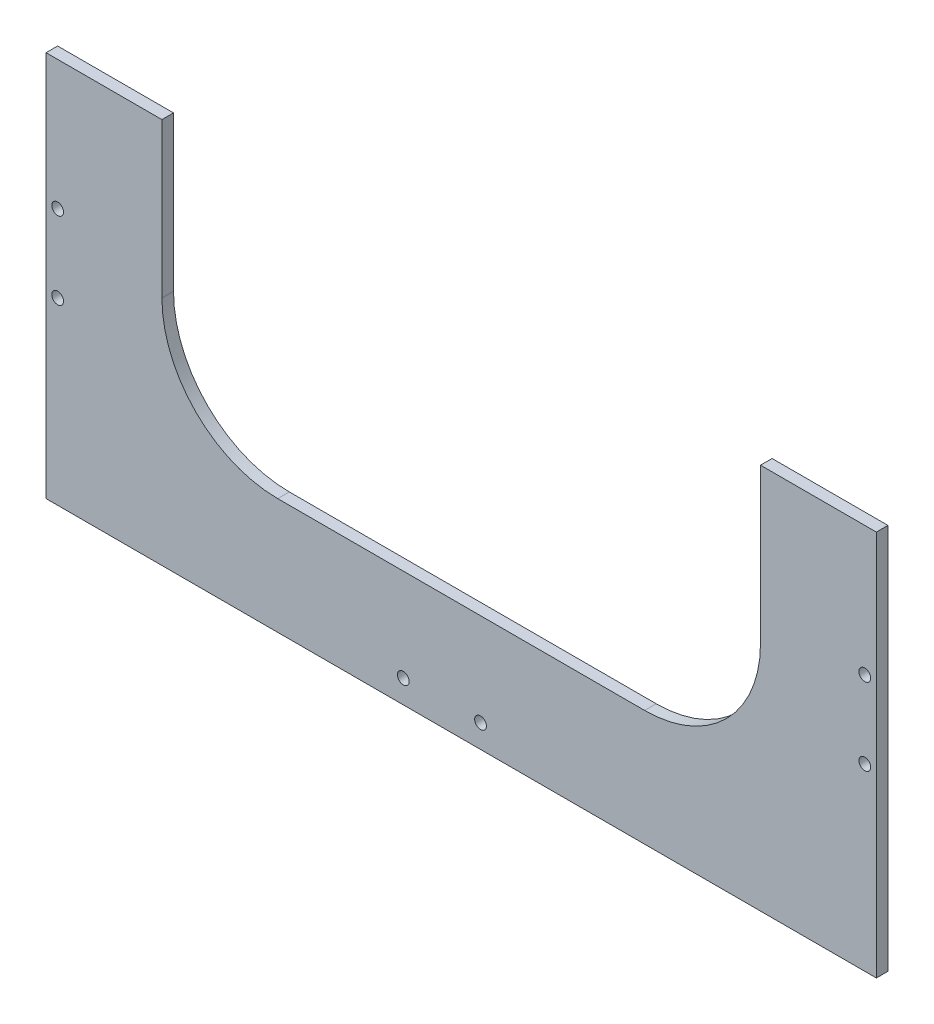
ISO-10303-21;
HEADER;
FILE_DESCRIPTION(('STEP AP214'),'2;1');
FILE_NAME('part.step','',(''),(''),'','','');
FILE_SCHEMA(('AUTOMOTIVE_DESIGN { 1 0 10303 214 1 1 1 1 }'));
ENDSEC;
DATA;
#1=APPLICATION_CONTEXT('core data for automotive mechanical design processes');
#2=APPLICATION_PROTOCOL_DEFINITION('international standard','automotive_design',2000,#1);
#3=PRODUCT_CONTEXT('',#1,'mechanical');
#4=PRODUCT('Part','Part','',(#3));
#5=PRODUCT_RELATED_PRODUCT_CATEGORY('part','',(#4));
#6=PRODUCT_DEFINITION_FORMATION('','',#4);
#7=PRODUCT_DEFINITION_CONTEXT('part definition',#1,'design');
#8=PRODUCT_DEFINITION('design','',#6,#7);
#9=PRODUCT_DEFINITION_SHAPE('','',#8);
#10=(LENGTH_UNIT() NAMED_UNIT(*) SI_UNIT(.MILLI.,.METRE.));
#11=(NAMED_UNIT(*) PLANE_ANGLE_UNIT() SI_UNIT($,.RADIAN.));
#12=(NAMED_UNIT(*) SI_UNIT($,.STERADIAN.) SOLID_ANGLE_UNIT());
#13=UNCERTAINTY_MEASURE_WITH_UNIT(LENGTH_MEASURE(1.E-05),#10,'distance_accuracy_value','');
#14=(GEOMETRIC_REPRESENTATION_CONTEXT(3) GLOBAL_UNCERTAINTY_ASSIGNED_CONTEXT((#13)) GLOBAL_UNIT_ASSIGNED_CONTEXT((#10,
#11,#12)) REPRESENTATION_CONTEXT('',''));
#15=CARTESIAN_POINT('',(0.,0.,0.));
#16=DIRECTION('',(0.,0.,1.));
#17=DIRECTION('',(1.,0.,0.));
#18=AXIS2_PLACEMENT_3D('',#15,#16,#17);
#19=CARTESIAN_POINT('',(-107.5,50.,1.5));
#20=DIRECTION('',(0.,-1.,0.));
#21=DIRECTION('',(0.,0.,-1.));
#22=AXIS2_PLACEMENT_3D('',#19,#20,#21);
#23=PLANE('',#22);
#24=DIRECTION('',(-1.,0.,0.));
#25=VECTOR('',#24,1.);
#26=CARTESIAN_POINT('',(-107.5,50.,-1.5));
#27=LINE('',#26,#25);
#28=CARTESIAN_POINT('',(107.5,50.,-1.5));
#29=VERTEX_POINT('',#28);
#30=CARTESIAN_POINT('',(77.5,50.,-1.5));
#31=VERTEX_POINT('',#30);
#32=EDGE_CURVE('E135',#29,#31,#27,.T.);
#33=ORIENTED_EDGE('',*,*,#32,.T.);
#34=DIRECTION('',(0.,0.,1.));
#35=VECTOR('',#34,1.);
#36=CARTESIAN_POINT('',(77.5,50.,1.5));
#37=LINE('',#36,#35);
#38=CARTESIAN_POINT('',(77.5,50.,1.5));
#39=VERTEX_POINT('',#38);
#40=EDGE_CURVE('E217',#31,#39,#37,.T.);
#41=ORIENTED_EDGE('',*,*,#40,.T.);
#42=DIRECTION('',(-1.,0.,0.));
#43=VECTOR('',#42,1.);
#44=CARTESIAN_POINT('',(-107.5,50.,1.5));
#45=LINE('',#44,#43);
#46=CARTESIAN_POINT('',(107.5,50.,1.5));
#47=VERTEX_POINT('',#46);
#48=EDGE_CURVE('E224',#47,#39,#45,.T.);
#49=ORIENTED_EDGE('',*,*,#48,.F.);
#50=DIRECTION('',(0.,0.,-1.));
#51=VECTOR('',#50,1.);
#52=CARTESIAN_POINT('',(107.5,50.,1.5));
#53=LINE('',#52,#51);
#54=EDGE_CURVE('E119',#47,#29,#53,.T.);
#55=ORIENTED_EDGE('',*,*,#54,.T.);
#56=EDGE_LOOP('',(#33,#41,#49,#55));
#57=FACE_BOUND('',#56,.T.);
#58=ADVANCED_FACE('F35',(#57),#23,.F.);
#59=CARTESIAN_POINT('',(107.5,-50.,1.5));
#60=DIRECTION('',(-1.,0.,0.));
#61=DIRECTION('',(0.,0.,1.));
#62=AXIS2_PLACEMENT_3D('',#59,#60,#61);
#63=PLANE('',#62);
#64=DIRECTION('',(0.,1.,0.));
#65=VECTOR('',#64,1.);
#66=CARTESIAN_POINT('',(107.5,-50.,-1.5));
#67=LINE('',#66,#65);
#68=CARTESIAN_POINT('',(107.5,-50.,-1.5));
#69=VERTEX_POINT('',#68);
#70=EDGE_CURVE('E136',#69,#29,#67,.T.);
#71=ORIENTED_EDGE('',*,*,#70,.T.);
#72=ORIENTED_EDGE('',*,*,#54,.F.);
#73=DIRECTION('',(0.,1.,0.));
#74=VECTOR('',#73,1.);
#75=CARTESIAN_POINT('',(107.5,-50.,1.5));
#76=LINE('',#75,#74);
#77=CARTESIAN_POINT('',(107.5,-50.,1.5));
#78=VERTEX_POINT('',#77);
#79=EDGE_CURVE('E147',#78,#47,#76,.T.);
#80=ORIENTED_EDGE('',*,*,#79,.F.);
#81=DIRECTION('',(0.,0.,-1.));
#82=VECTOR('',#81,1.);
#83=CARTESIAN_POINT('',(107.5,-50.,1.5));
#84=LINE('',#83,#82);
#85=EDGE_CURVE('E148',#78,#69,#84,.T.);
#86=ORIENTED_EDGE('',*,*,#85,.T.);
#87=EDGE_LOOP('',(#71,#72,#80,#86));
#88=FACE_BOUND('',#87,.T.);
#89=ADVANCED_FACE('F239',(#88),#63,.F.);
#90=CARTESIAN_POINT('',(-77.5,50.,1.5));
#91=VERTEX_POINT('',#90);
#92=CARTESIAN_POINT('',(-107.5,50.,1.5));
#93=VERTEX_POINT('',#92);
#94=EDGE_CURVE('E126',#91,#93,#45,.T.);
#95=ORIENTED_EDGE('',*,*,#94,.F.);
#96=DIRECTION('',(0.,0.,-1.));
#97=VECTOR('',#96,1.);
#98=CARTESIAN_POINT('',(-77.5,50.,1.5));
#99=LINE('',#98,#97);
#100=CARTESIAN_POINT('',(-77.5,50.,-1.5));
#101=VERTEX_POINT('',#100);
#102=EDGE_CURVE('E113',#91,#101,#99,.T.);
#103=ORIENTED_EDGE('',*,*,#102,.T.);
#104=CARTESIAN_POINT('',(-107.5,50.,-1.5));
#105=VERTEX_POINT('',#104);
#106=EDGE_CURVE('E124',#101,#105,#27,.T.);
#107=ORIENTED_EDGE('',*,*,#106,.T.);
#108=DIRECTION('',(0.,0.,-1.));
#109=VECTOR('',#108,1.);
#110=CARTESIAN_POINT('',(-107.5,50.,1.5));
#111=LINE('',#110,#109);
#112=EDGE_CURVE('E155',#93,#105,#111,.T.);
#113=ORIENTED_EDGE('',*,*,#112,.F.);
#114=EDGE_LOOP('',(#95,#103,#107,#113));
#115=FACE_BOUND('',#114,.T.);
#116=ADVANCED_FACE('F122',(#115),#23,.F.);
#117=CARTESIAN_POINT('',(-107.5,-50.,1.5));
#118=DIRECTION('',(1.,0.,0.));
#119=DIRECTION('',(0.,0.,-1.));
#120=AXIS2_PLACEMENT_3D('',#117,#118,#119);
#121=PLANE('',#120);
#122=DIRECTION('',(0.,-1.,0.));
#123=VECTOR('',#122,1.);
#124=CARTESIAN_POINT('',(-107.5,-50.,-1.5));
#125=LINE('',#124,#123);
#126=CARTESIAN_POINT('',(-107.5,-50.,-1.5));
#127=VERTEX_POINT('',#126);
#128=EDGE_CURVE('E134',#105,#127,#125,.T.);
#129=ORIENTED_EDGE('',*,*,#128,.T.);
#130=DIRECTION('',(0.,0.,-1.));
#131=VECTOR('',#130,1.);
#132=CARTESIAN_POINT('',(-107.5,-50.,1.5));
#133=LINE('',#132,#131);
#134=CARTESIAN_POINT('',(-107.5,-50.,1.5));
#135=VERTEX_POINT('',#134);
#136=EDGE_CURVE('E151',#135,#127,#133,.T.);
#137=ORIENTED_EDGE('',*,*,#136,.F.);
#138=DIRECTION('',(0.,-1.,0.));
#139=VECTOR('',#138,1.);
#140=CARTESIAN_POINT('',(-107.5,-50.,1.5));
#141=LINE('',#140,#139);
#142=EDGE_CURVE('E227',#93,#135,#141,.T.);
#143=ORIENTED_EDGE('',*,*,#142,.F.);
#144=ORIENTED_EDGE('',*,*,#112,.T.);
#145=EDGE_LOOP('',(#129,#137,#143,#144));
#146=FACE_BOUND('',#145,.T.);
#147=ADVANCED_FACE('F271',(#146),#121,.F.);
#148=CARTESIAN_POINT('',(-107.5,-50.,1.5));
#149=DIRECTION('',(0.,1.,0.));
#150=DIRECTION('',(0.,0.,1.));
#151=AXIS2_PLACEMENT_3D('',#148,#149,#150);
#152=PLANE('',#151);
#153=DIRECTION('',(1.,0.,0.));
#154=VECTOR('',#153,1.);
#155=CARTESIAN_POINT('',(-107.5,-50.,-1.5));
#156=LINE('',#155,#154);
#157=EDGE_CURVE('E145',#127,#69,#156,.T.);
#158=ORIENTED_EDGE('',*,*,#157,.T.);
#159=ORIENTED_EDGE('',*,*,#85,.F.);
#160=DIRECTION('',(1.,0.,0.));
#161=VECTOR('',#160,1.);
#162=CARTESIAN_POINT('',(-107.5,-50.,1.5));
#163=LINE('',#162,#161);
#164=EDGE_CURVE('E152',#135,#78,#163,.T.);
#165=ORIENTED_EDGE('',*,*,#164,.F.);
#166=ORIENTED_EDGE('',*,*,#136,.T.);
#167=EDGE_LOOP('',(#158,#159,#165,#166));
#168=FACE_BOUND('',#167,.T.);
#169=ADVANCED_FACE('F236',(#168),#152,.F.);
#170=CARTESIAN_POINT('',(0.,0.,1.5));
#171=DIRECTION('',(0.,0.,-1.));
#172=DIRECTION('',(-1.,0.,0.));
#173=AXIS2_PLACEMENT_3D('',#170,#171,#172);
#174=PLANE('',#173);
#175=CARTESIAN_POINT('',(104.5,16.4999999999998,1.5));
#176=DIRECTION('',(0.,0.,-1.));
#177=DIRECTION('',(-1.,0.,0.));
#178=AXIS2_PLACEMENT_3D('',#175,#176,#177);
#179=CIRCLE('',#178,1.52499999999998);
#180=CARTESIAN_POINT('',(102.975,16.4999999999998,1.5));
#181=VERTEX_POINT('',#180);
#182=EDGE_CURVE('E187',#181,#181,#179,.T.);
#183=ORIENTED_EDGE('',*,*,#182,.T.);
#184=EDGE_LOOP('',(#183));
#185=FACE_BOUND('',#184,.T.);
#186=CARTESIAN_POINT('',(104.5,-3.5000000000002,1.5));
#187=DIRECTION('',(0.,0.,-1.));
#188=DIRECTION('',(-1.,0.,0.));
#189=AXIS2_PLACEMENT_3D('',#186,#187,#188);
#190=CIRCLE('',#189,1.52499999999998);
#191=CARTESIAN_POINT('',(102.975,-3.5000000000002,1.5));
#192=VERTEX_POINT('',#191);
#193=EDGE_CURVE('E193',#192,#192,#190,.T.);
#194=ORIENTED_EDGE('',*,*,#193,.T.);
#195=EDGE_LOOP('',(#194));
#196=FACE_BOUND('',#195,.T.);
#197=CARTESIAN_POINT('',(-104.5,16.4999999999998,1.5));
#198=DIRECTION('',(0.,0.,1.));
#199=DIRECTION('',(1.,0.,0.));
#200=AXIS2_PLACEMENT_3D('',#197,#198,#199);
#201=CIRCLE('',#200,1.52499999999998);
#202=CARTESIAN_POINT('',(-102.975,16.4999999999998,1.5));
#203=VERTEX_POINT('',#202);
#204=EDGE_CURVE('E182',#203,#203,#201,.T.);
#205=ORIENTED_EDGE('',*,*,#204,.F.);
#206=EDGE_LOOP('',(#205));
#207=FACE_BOUND('',#206,.T.);
#208=CARTESIAN_POINT('',(-104.5,-3.5000000000002,1.5));
#209=DIRECTION('',(0.,0.,1.));
#210=DIRECTION('',(1.,0.,0.));
#211=AXIS2_PLACEMENT_3D('',#208,#209,#210);
#212=CIRCLE('',#211,1.52499999999998);
#213=CARTESIAN_POINT('',(-102.975,-3.5000000000002,1.5));
#214=VERTEX_POINT('',#213);
#215=EDGE_CURVE('E191',#214,#214,#212,.T.);
#216=ORIENTED_EDGE('',*,*,#215,.F.);
#217=EDGE_LOOP('',(#216));
#218=FACE_BOUND('',#217,.T.);
#219=CARTESIAN_POINT('',(5.,-44.,1.5));
#220=DIRECTION('',(0.,0.,-1.));
#221=DIRECTION('',(-1.,0.,0.));
#222=AXIS2_PLACEMENT_3D('',#219,#220,#221);
#223=CIRCLE('',#222,1.525);
#224=CARTESIAN_POINT('',(3.475,-44.,1.5));
#225=VERTEX_POINT('',#224);
#226=EDGE_CURVE('E128',#225,#225,#223,.T.);
#227=ORIENTED_EDGE('',*,*,#226,.T.);
#228=EDGE_LOOP('',(#227));
#229=FACE_BOUND('',#228,.T.);
#230=CARTESIAN_POINT('',(-15.,-44.,1.5));
#231=DIRECTION('',(0.,0.,-1.));
#232=DIRECTION('',(-1.,0.,0.));
#233=AXIS2_PLACEMENT_3D('',#230,#231,#232);
#234=CIRCLE('',#233,1.525);
#235=CARTESIAN_POINT('',(-16.525,-44.,1.5));
#236=VERTEX_POINT('',#235);
#237=EDGE_CURVE('E207',#236,#236,#234,.T.);
#238=ORIENTED_EDGE('',*,*,#237,.T.);
#239=EDGE_LOOP('',(#238));
#240=FACE_BOUND('',#239,.T.);
#241=ORIENTED_EDGE('',*,*,#48,.T.);
#242=DIRECTION('',(0.,-1.,0.));
#243=VECTOR('',#242,1.);
#244=CARTESIAN_POINT('',(77.5,0.,1.5));
#245=LINE('',#244,#243);
#246=CARTESIAN_POINT('',(77.5,10.,1.5));
#247=VERTEX_POINT('',#246);
#248=EDGE_CURVE('E140',#39,#247,#245,.T.);
#249=ORIENTED_EDGE('',*,*,#248,.T.);
#250=CARTESIAN_POINT('',(47.5,10.,1.5));
#251=DIRECTION('',(0.,0.,-1.));
#252=DIRECTION('',(-1.,0.,0.));
#253=AXIS2_PLACEMENT_3D('',#250,#251,#252);
#254=CIRCLE('',#253,30.);
#255=CARTESIAN_POINT('',(47.5,-20.,1.5));
#256=VERTEX_POINT('',#255);
#257=EDGE_CURVE('E173',#247,#256,#254,.T.);
#258=ORIENTED_EDGE('',*,*,#257,.T.);
#259=DIRECTION('',(-1.,0.,0.));
#260=VECTOR('',#259,1.);
#261=CARTESIAN_POINT('',(0.,-20.,1.5));
#262=LINE('',#261,#260);
#263=CARTESIAN_POINT('',(-47.5,-20.,1.5));
#264=VERTEX_POINT('',#263);
#265=EDGE_CURVE('E215',#256,#264,#262,.T.);
#266=ORIENTED_EDGE('',*,*,#265,.T.);
#267=CARTESIAN_POINT('',(-47.5,10.,1.5));
#268=DIRECTION('',(0.,0.,-1.));
#269=DIRECTION('',(-1.,0.,0.));
#270=AXIS2_PLACEMENT_3D('',#267,#268,#269);
#271=CIRCLE('',#270,30.);
#272=CARTESIAN_POINT('',(-77.5,9.99999999999999,1.5));
#273=VERTEX_POINT('',#272);
#274=EDGE_CURVE('E44',#264,#273,#271,.T.);
#275=ORIENTED_EDGE('',*,*,#274,.T.);
#276=DIRECTION('',(0.,1.,0.));
#277=VECTOR('',#276,1.);
#278=CARTESIAN_POINT('',(-77.5,0.,1.5));
#279=LINE('',#278,#277);
#280=EDGE_CURVE('E127',#273,#91,#279,.T.);
#281=ORIENTED_EDGE('',*,*,#280,.T.);
#282=ORIENTED_EDGE('',*,*,#94,.T.);
#283=ORIENTED_EDGE('',*,*,#142,.T.);
#284=ORIENTED_EDGE('',*,*,#164,.T.);
#285=ORIENTED_EDGE('',*,*,#79,.T.);
#286=EDGE_LOOP('',(#241,#249,#258,#266,#275,#281,#282,#283,#284,#285));
#287=FACE_BOUND('',#286,.T.);
#288=ADVANCED_FACE('F230',(#185,#196,#207,#218,#229,#240,#287),#174,.F.);
#289=CARTESIAN_POINT('',(0.,0.,-1.5));
#290=DIRECTION('',(0.,0.,-1.));
#291=DIRECTION('',(-1.,0.,0.));
#292=AXIS2_PLACEMENT_3D('',#289,#290,#291);
#293=PLANE('',#292);
#294=CARTESIAN_POINT('',(104.5,16.4999999999998,-1.5));
#295=DIRECTION('',(0.,0.,-1.));
#296=DIRECTION('',(-1.,0.,0.));
#297=AXIS2_PLACEMENT_3D('',#294,#295,#296);
#298=CIRCLE('',#297,1.52499999999998);
#299=CARTESIAN_POINT('',(102.975,16.4999999999998,-1.5));
#300=VERTEX_POINT('',#299);
#301=EDGE_CURVE('E39',#300,#300,#298,.F.);
#302=ORIENTED_EDGE('',*,*,#301,.T.);
#303=EDGE_LOOP('',(#302));
#304=FACE_BOUND('',#303,.T.);
#305=CARTESIAN_POINT('',(104.5,-3.5000000000002,-1.5));
#306=DIRECTION('',(0.,0.,-1.));
#307=DIRECTION('',(-1.,0.,0.));
#308=AXIS2_PLACEMENT_3D('',#305,#306,#307);
#309=CIRCLE('',#308,1.52499999999998);
#310=CARTESIAN_POINT('',(102.975,-3.5000000000002,-1.5));
#311=VERTEX_POINT('',#310);
#312=EDGE_CURVE('E185',#311,#311,#309,.F.);
#313=ORIENTED_EDGE('',*,*,#312,.T.);
#314=EDGE_LOOP('',(#313));
#315=FACE_BOUND('',#314,.T.);
#316=CARTESIAN_POINT('',(-104.5,16.4999999999998,-1.5));
#317=DIRECTION('',(0.,0.,-1.));
#318=DIRECTION('',(-1.,0.,0.));
#319=AXIS2_PLACEMENT_3D('',#316,#317,#318);
#320=CIRCLE('',#319,1.52499999999998);
#321=CARTESIAN_POINT('',(-106.025,16.4999999999998,-1.5));
#322=VERTEX_POINT('',#321);
#323=EDGE_CURVE('E181',#322,#322,#320,.T.);
#324=ORIENTED_EDGE('',*,*,#323,.F.);
#325=EDGE_LOOP('',(#324));
#326=FACE_BOUND('',#325,.T.);
#327=CARTESIAN_POINT('',(-104.5,-3.5000000000002,-1.5));
#328=DIRECTION('',(0.,0.,-1.));
#329=DIRECTION('',(-1.,0.,0.));
#330=AXIS2_PLACEMENT_3D('',#327,#328,#329);
#331=CIRCLE('',#330,1.52499999999998);
#332=CARTESIAN_POINT('',(-106.025,-3.5000000000002,-1.5));
#333=VERTEX_POINT('',#332);
#334=EDGE_CURVE('E178',#333,#333,#331,.T.);
#335=ORIENTED_EDGE('',*,*,#334,.F.);
#336=EDGE_LOOP('',(#335));
#337=FACE_BOUND('',#336,.T.);
#338=CARTESIAN_POINT('',(5.,-44.,-1.5));
#339=DIRECTION('',(0.,0.,-1.));
#340=DIRECTION('',(-1.,0.,0.));
#341=AXIS2_PLACEMENT_3D('',#338,#339,#340);
#342=CIRCLE('',#341,1.525);
#343=CARTESIAN_POINT('',(3.475,-44.,-1.5));
#344=VERTEX_POINT('',#343);
#345=EDGE_CURVE('E204',#344,#344,#342,.T.);
#346=ORIENTED_EDGE('',*,*,#345,.F.);
#347=EDGE_LOOP('',(#346));
#348=FACE_BOUND('',#347,.T.);
#349=CARTESIAN_POINT('',(-15.,-44.,-1.5));
#350=DIRECTION('',(0.,0.,-1.));
#351=DIRECTION('',(-1.,0.,0.));
#352=AXIS2_PLACEMENT_3D('',#349,#350,#351);
#353=CIRCLE('',#352,1.525);
#354=CARTESIAN_POINT('',(-16.525,-44.,-1.5));
#355=VERTEX_POINT('',#354);
#356=EDGE_CURVE('E184',#355,#355,#353,.T.);
#357=ORIENTED_EDGE('',*,*,#356,.F.);
#358=EDGE_LOOP('',(#357));
#359=FACE_BOUND('',#358,.T.);
#360=DIRECTION('',(0.,-1.,0.));
#361=VECTOR('',#360,1.);
#362=CARTESIAN_POINT('',(77.5,0.,-1.5));
#363=LINE('',#362,#361);
#364=CARTESIAN_POINT('',(77.5,10.,-1.5));
#365=VERTEX_POINT('',#364);
#366=EDGE_CURVE('E161',#31,#365,#363,.T.);
#367=ORIENTED_EDGE('',*,*,#366,.F.);
#368=ORIENTED_EDGE('',*,*,#32,.F.);
#369=ORIENTED_EDGE('',*,*,#70,.F.);
#370=ORIENTED_EDGE('',*,*,#157,.F.);
#371=ORIENTED_EDGE('',*,*,#128,.F.);
#372=ORIENTED_EDGE('',*,*,#106,.F.);
#373=DIRECTION('',(0.,1.,0.));
#374=VECTOR('',#373,1.);
#375=CARTESIAN_POINT('',(-77.5,0.,-1.5));
#376=LINE('',#375,#374);
#377=CARTESIAN_POINT('',(-77.5,9.99999999999999,-1.5));
#378=VERTEX_POINT('',#377);
#379=EDGE_CURVE('E110',#378,#101,#376,.T.);
#380=ORIENTED_EDGE('',*,*,#379,.F.);
#381=CARTESIAN_POINT('',(-47.5,10.,-1.5));
#382=DIRECTION('',(0.,0.,-1.));
#383=DIRECTION('',(-1.,0.,0.));
#384=AXIS2_PLACEMENT_3D('',#381,#382,#383);
#385=CIRCLE('',#384,30.);
#386=CARTESIAN_POINT('',(-47.5,-20.,-1.5));
#387=VERTEX_POINT('',#386);
#388=EDGE_CURVE('E11',#378,#387,#385,.F.);
#389=ORIENTED_EDGE('',*,*,#388,.T.);
#390=DIRECTION('',(-1.,0.,0.));
#391=VECTOR('',#390,1.);
#392=CARTESIAN_POINT('',(0.,-20.,-1.5));
#393=LINE('',#392,#391);
#394=CARTESIAN_POINT('',(47.5,-20.,-1.5));
#395=VERTEX_POINT('',#394);
#396=EDGE_CURVE('E118',#395,#387,#393,.T.);
#397=ORIENTED_EDGE('',*,*,#396,.F.);
#398=CARTESIAN_POINT('',(47.5,10.,-1.5));
#399=DIRECTION('',(0.,0.,-1.));
#400=DIRECTION('',(-1.,0.,0.));
#401=AXIS2_PLACEMENT_3D('',#398,#399,#400);
#402=CIRCLE('',#401,30.);
#403=EDGE_CURVE('E175',#395,#365,#402,.F.);
#404=ORIENTED_EDGE('',*,*,#403,.T.);
#405=EDGE_LOOP('',(#367,#368,#369,#370,#371,#372,#380,#389,#397,#404));
#406=FACE_BOUND('',#405,.T.);
#407=ADVANCED_FACE('F132',(#304,#315,#326,#337,#348,#359,#406),#293,.T.);
#408=CARTESIAN_POINT('',(77.5,-20.,-20.));
#409=DIRECTION('',(1.,0.,0.));
#410=DIRECTION('',(0.,0.,-1.));
#411=AXIS2_PLACEMENT_3D('',#408,#409,#410);
#412=PLANE('',#411);
#413=ORIENTED_EDGE('',*,*,#366,.T.);
#414=DIRECTION('',(0.,0.,1.));
#415=VECTOR('',#414,1.);
#416=CARTESIAN_POINT('',(77.5,10.,1.5));
#417=LINE('',#416,#415);
#418=EDGE_CURVE('E164',#365,#247,#417,.T.);
#419=ORIENTED_EDGE('',*,*,#418,.T.);
#420=ORIENTED_EDGE('',*,*,#248,.F.);
#421=ORIENTED_EDGE('',*,*,#40,.F.);
#422=EDGE_LOOP('',(#413,#419,#420,#421));
#423=FACE_BOUND('',#422,.T.);
#424=ADVANCED_FACE('F243',(#423),#412,.F.);
#425=CARTESIAN_POINT('',(-77.5,-20.,-20.));
#426=DIRECTION('',(0.,-1.,0.));
#427=DIRECTION('',(1.,0.,0.));
#428=AXIS2_PLACEMENT_3D('',#425,#426,#427);
#429=PLANE('',#428);
#430=ORIENTED_EDGE('',*,*,#265,.F.);
#431=DIRECTION('',(0.,0.,1.));
#432=VECTOR('',#431,1.);
#433=CARTESIAN_POINT('',(47.5,-20.,-1.5));
#434=LINE('',#433,#432);
#435=EDGE_CURVE('E170',#256,#395,#434,.F.);
#436=ORIENTED_EDGE('',*,*,#435,.T.);
#437=ORIENTED_EDGE('',*,*,#396,.T.);
#438=DIRECTION('',(0.,0.,1.));
#439=VECTOR('',#438,1.);
#440=CARTESIAN_POINT('',(-47.5,-20.,1.5));
#441=LINE('',#440,#439);
#442=EDGE_CURVE('E167',#387,#264,#441,.T.);
#443=ORIENTED_EDGE('',*,*,#442,.T.);
#444=EDGE_LOOP('',(#430,#436,#437,#443));
#445=FACE_BOUND('',#444,.T.);
#446=ADVANCED_FACE('F251',(#445),#429,.F.);
#447=CARTESIAN_POINT('',(-77.5,-20.,-20.));
#448=DIRECTION('',(-1.,0.,0.));
#449=DIRECTION('',(0.,-1.,0.));
#450=AXIS2_PLACEMENT_3D('',#447,#448,#449);
#451=PLANE('',#450);
#452=ORIENTED_EDGE('',*,*,#280,.F.);
#453=DIRECTION('',(0.,0.,1.));
#454=VECTOR('',#453,1.);
#455=CARTESIAN_POINT('',(-77.5,9.99999999999999,-1.5));
#456=LINE('',#455,#454);
#457=EDGE_CURVE('E58',#273,#378,#456,.F.);
#458=ORIENTED_EDGE('',*,*,#457,.T.);
#459=ORIENTED_EDGE('',*,*,#379,.T.);
#460=ORIENTED_EDGE('',*,*,#102,.F.);
#461=EDGE_LOOP('',(#452,#458,#459,#460));
#462=FACE_BOUND('',#461,.T.);
#463=ADVANCED_FACE('F112',(#462),#451,.F.);
#464=CARTESIAN_POINT('',(47.5,10.,-20.));
#465=DIRECTION('',(0.,0.,-1.));
#466=DIRECTION('',(-1.,0.,0.));
#467=AXIS2_PLACEMENT_3D('',#464,#465,#466);
#468=CYLINDRICAL_SURFACE('',#467,30.);
#469=ORIENTED_EDGE('',*,*,#403,.F.);
#470=ORIENTED_EDGE('',*,*,#435,.F.);
#471=ORIENTED_EDGE('',*,*,#257,.F.);
#472=ORIENTED_EDGE('',*,*,#418,.F.);
#473=EDGE_LOOP('',(#469,#470,#471,#472));
#474=FACE_BOUND('',#473,.T.);
#475=ADVANCED_FACE('F247',(#474),#468,.F.);
#476=CARTESIAN_POINT('',(-47.5,10.,-20.));
#477=DIRECTION('',(0.,0.,-1.));
#478=DIRECTION('',(-1.,0.,0.));
#479=AXIS2_PLACEMENT_3D('',#476,#477,#478);
#480=CYLINDRICAL_SURFACE('',#479,30.);
#481=ORIENTED_EDGE('',*,*,#388,.F.);
#482=ORIENTED_EDGE('',*,*,#457,.F.);
#483=ORIENTED_EDGE('',*,*,#274,.F.);
#484=ORIENTED_EDGE('',*,*,#442,.F.);
#485=EDGE_LOOP('',(#481,#482,#483,#484));
#486=FACE_BOUND('',#485,.T.);
#487=ADVANCED_FACE('F37',(#486),#480,.F.);
#488=CARTESIAN_POINT('',(-15.,-44.,8.5));
#489=DIRECTION('',(0.,0.,-1.));
#490=DIRECTION('',(-1.,0.,0.));
#491=AXIS2_PLACEMENT_3D('',#488,#489,#490);
#492=CYLINDRICAL_SURFACE('',#491,1.525);
#493=ORIENTED_EDGE('',*,*,#356,.T.);
#494=EDGE_LOOP('',(#493));
#495=FACE_BOUND('',#494,.T.);
#496=ORIENTED_EDGE('',*,*,#237,.F.);
#497=EDGE_LOOP('',(#496));
#498=FACE_BOUND('',#497,.T.);
#499=ADVANCED_FACE('F255',(#495,#498),#492,.F.);
#500=CARTESIAN_POINT('',(5.,-44.,8.5));
#501=DIRECTION('',(0.,0.,-1.));
#502=DIRECTION('',(-1.,0.,0.));
#503=AXIS2_PLACEMENT_3D('',#500,#501,#502);
#504=CYLINDRICAL_SURFACE('',#503,1.525);
#505=ORIENTED_EDGE('',*,*,#345,.T.);
#506=EDGE_LOOP('',(#505));
#507=FACE_BOUND('',#506,.T.);
#508=ORIENTED_EDGE('',*,*,#226,.F.);
#509=EDGE_LOOP('',(#508));
#510=FACE_BOUND('',#509,.T.);
#511=ADVANCED_FACE('F260',(#507,#510),#504,.F.);
#512=CARTESIAN_POINT('',(-104.5,-3.5000000000002,-8.5));
#513=DIRECTION('',(0.,0.,1.));
#514=DIRECTION('',(1.,0.,0.));
#515=AXIS2_PLACEMENT_3D('',#512,#513,#514);
#516=CYLINDRICAL_SURFACE('',#515,1.52499999999998);
#517=ORIENTED_EDGE('',*,*,#334,.T.);
#518=EDGE_LOOP('',(#517));
#519=FACE_BOUND('',#518,.T.);
#520=ORIENTED_EDGE('',*,*,#215,.T.);
#521=EDGE_LOOP('',(#520));
#522=FACE_BOUND('',#521,.T.);
#523=ADVANCED_FACE('F294',(#519,#522),#516,.F.);
#524=CARTESIAN_POINT('',(-104.5,16.4999999999998,-8.5));
#525=DIRECTION('',(0.,0.,1.));
#526=DIRECTION('',(1.,0.,0.));
#527=AXIS2_PLACEMENT_3D('',#524,#525,#526);
#528=CYLINDRICAL_SURFACE('',#527,1.52499999999998);
#529=ORIENTED_EDGE('',*,*,#323,.T.);
#530=EDGE_LOOP('',(#529));
#531=FACE_BOUND('',#530,.T.);
#532=ORIENTED_EDGE('',*,*,#204,.T.);
#533=EDGE_LOOP('',(#532));
#534=FACE_BOUND('',#533,.T.);
#535=ADVANCED_FACE('F298',(#531,#534),#528,.F.);
#536=CARTESIAN_POINT('',(104.5,-3.5000000000002,-8.5));
#537=DIRECTION('',(0.,0.,1.));
#538=DIRECTION('',(1.,0.,0.));
#539=AXIS2_PLACEMENT_3D('',#536,#537,#538);
#540=CYLINDRICAL_SURFACE('',#539,1.52499999999998);
#541=ORIENTED_EDGE('',*,*,#312,.F.);
#542=EDGE_LOOP('',(#541));
#543=FACE_BOUND('',#542,.T.);
#544=ORIENTED_EDGE('',*,*,#193,.F.);
#545=EDGE_LOOP('',(#544));
#546=FACE_BOUND('',#545,.T.);
#547=ADVANCED_FACE('F302',(#543,#546),#540,.F.);
#548=CARTESIAN_POINT('',(104.5,16.4999999999998,-8.5));
#549=DIRECTION('',(0.,0.,1.));
#550=DIRECTION('',(1.,0.,0.));
#551=AXIS2_PLACEMENT_3D('',#548,#549,#550);
#552=CYLINDRICAL_SURFACE('',#551,1.52499999999998);
#553=ORIENTED_EDGE('',*,*,#301,.F.);
#554=EDGE_LOOP('',(#553));
#555=FACE_BOUND('',#554,.T.);
#556=ORIENTED_EDGE('',*,*,#182,.F.);
#557=EDGE_LOOP('',(#556));
#558=FACE_BOUND('',#557,.T.);
#559=ADVANCED_FACE('F306',(#555,#558),#552,.F.);
#560=CLOSED_SHELL('',(#58,#89,#116,#147,#169,#288,#407,#424,#446,#463,#475,#487,#499,#511,#523,
#535,#547,#559));
#561=MANIFOLD_SOLID_BREP('B2',#560);
#562=ADVANCED_BREP_SHAPE_REPRESENTATION('',(#18,#561),#14);
#563=SHAPE_DEFINITION_REPRESENTATION(#9,#562);
ENDSEC;
END-ISO-10303-21;
